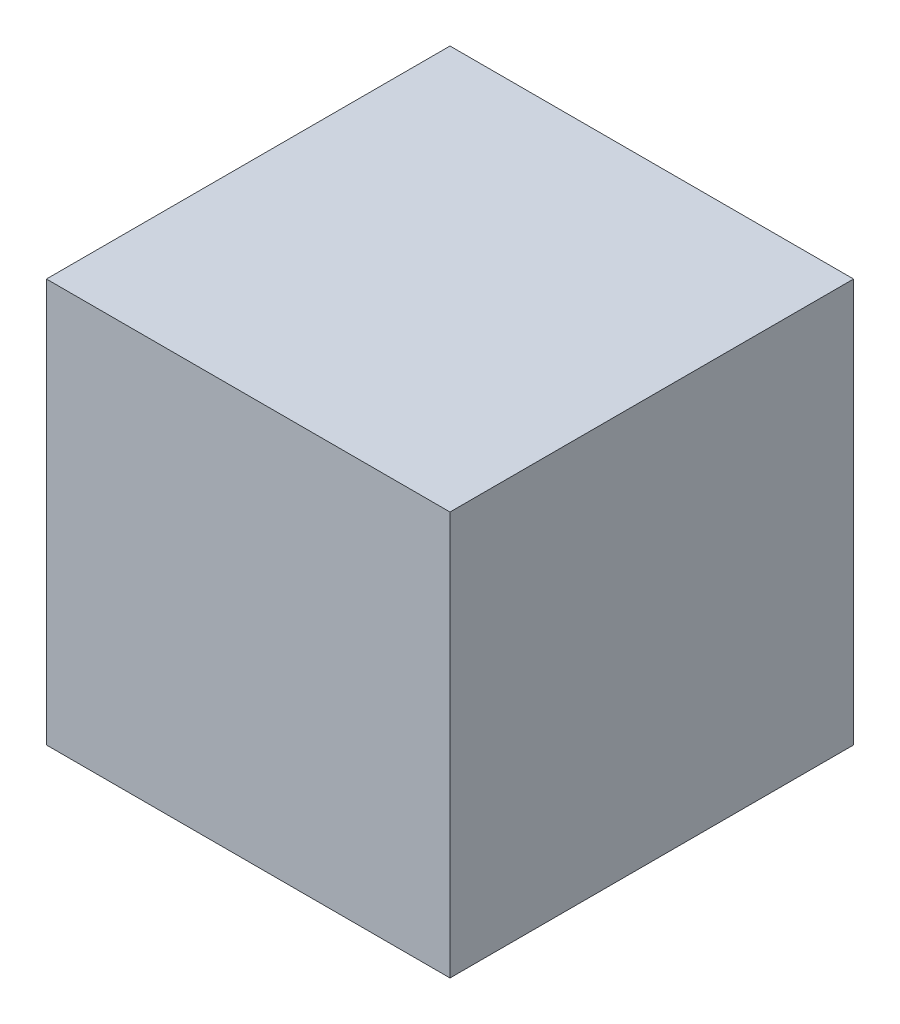
ISO-10303-21;
HEADER;
FILE_DESCRIPTION(('STEP AP214'),'2;1');
FILE_NAME('part.step','',(''),(''),'','','');
FILE_SCHEMA(('AUTOMOTIVE_DESIGN { 1 0 10303 214 1 1 1 1 }'));
ENDSEC;
DATA;
#1=APPLICATION_CONTEXT('core data for automotive mechanical design processes');
#2=APPLICATION_PROTOCOL_DEFINITION('international standard','automotive_design',2000,#1);
#3=PRODUCT_CONTEXT('',#1,'mechanical');
#4=PRODUCT('Part','Part','',(#3));
#5=PRODUCT_RELATED_PRODUCT_CATEGORY('part','',(#4));
#6=PRODUCT_DEFINITION_FORMATION('','',#4);
#7=PRODUCT_DEFINITION_CONTEXT('part definition',#1,'design');
#8=PRODUCT_DEFINITION('design','',#6,#7);
#9=PRODUCT_DEFINITION_SHAPE('','',#8);
#10=(LENGTH_UNIT() NAMED_UNIT(*) SI_UNIT(.MILLI.,.METRE.));
#11=(NAMED_UNIT(*) PLANE_ANGLE_UNIT() SI_UNIT($,.RADIAN.));
#12=(NAMED_UNIT(*) SI_UNIT($,.STERADIAN.) SOLID_ANGLE_UNIT());
#13=UNCERTAINTY_MEASURE_WITH_UNIT(LENGTH_MEASURE(1.E-05),#10,'distance_accuracy_value','');
#14=(GEOMETRIC_REPRESENTATION_CONTEXT(3) GLOBAL_UNCERTAINTY_ASSIGNED_CONTEXT((#13)) GLOBAL_UNIT_ASSIGNED_CONTEXT((#10,
#11,#12)) REPRESENTATION_CONTEXT('',''));
#15=CARTESIAN_POINT('',(0.,0.,0.));
#16=DIRECTION('',(0.,0.,1.));
#17=DIRECTION('',(1.,0.,0.));
#18=AXIS2_PLACEMENT_3D('',#15,#16,#17);
#19=CARTESIAN_POINT('',(0.,0.,25.4));
#20=DIRECTION('',(1.,0.,0.));
#21=DIRECTION('',(0.,0.,-1.));
#22=AXIS2_PLACEMENT_3D('',#19,#20,#21);
#23=PLANE('',#22);
#24=DIRECTION('',(0.,-1.,0.));
#25=VECTOR('',#24,1.);
#26=CARTESIAN_POINT('',(0.,0.,0.));
#27=LINE('',#26,#25);
#28=CARTESIAN_POINT('',(0.,25.4,0.));
#29=VERTEX_POINT('',#28);
#30=CARTESIAN_POINT('',(0.,0.,0.));
#31=VERTEX_POINT('',#30);
#32=EDGE_CURVE('E97',#29,#31,#27,.T.);
#33=ORIENTED_EDGE('',*,*,#32,.T.);
#34=DIRECTION('',(0.,0.,-1.));
#35=VECTOR('',#34,1.);
#36=CARTESIAN_POINT('',(0.,0.,25.4));
#37=LINE('',#36,#35);
#38=CARTESIAN_POINT('',(0.,0.,25.4));
#39=VERTEX_POINT('',#38);
#40=EDGE_CURVE('E11',#39,#31,#37,.T.);
#41=ORIENTED_EDGE('',*,*,#40,.F.);
#42=DIRECTION('',(0.,-1.,0.));
#43=VECTOR('',#42,1.);
#44=CARTESIAN_POINT('',(0.,0.,25.4));
#45=LINE('',#44,#43);
#46=CARTESIAN_POINT('',(0.,25.4,25.4));
#47=VERTEX_POINT('',#46);
#48=EDGE_CURVE('E85',#47,#39,#45,.T.);
#49=ORIENTED_EDGE('',*,*,#48,.F.);
#50=DIRECTION('',(0.,0.,-1.));
#51=VECTOR('',#50,1.);
#52=CARTESIAN_POINT('',(0.,25.4,25.4));
#53=LINE('',#52,#51);
#54=EDGE_CURVE('E93',#47,#29,#53,.T.);
#55=ORIENTED_EDGE('',*,*,#54,.T.);
#56=EDGE_LOOP('',(#33,#41,#49,#55));
#57=FACE_BOUND('',#56,.T.);
#58=ADVANCED_FACE('F34',(#57),#23,.F.);
#59=CARTESIAN_POINT('',(0.,0.,25.4));
#60=DIRECTION('',(0.,1.,0.));
#61=DIRECTION('',(0.,0.,1.));
#62=AXIS2_PLACEMENT_3D('',#59,#60,#61);
#63=PLANE('',#62);
#64=DIRECTION('',(1.,0.,0.));
#65=VECTOR('',#64,1.);
#66=CARTESIAN_POINT('',(0.,0.,0.));
#67=LINE('',#66,#65);
#68=CARTESIAN_POINT('',(25.4,0.,0.));
#69=VERTEX_POINT('',#68);
#70=EDGE_CURVE('E89',#31,#69,#67,.T.);
#71=ORIENTED_EDGE('',*,*,#70,.T.);
#72=DIRECTION('',(0.,0.,-1.));
#73=VECTOR('',#72,1.);
#74=CARTESIAN_POINT('',(25.4,0.,25.4));
#75=LINE('',#74,#73);
#76=CARTESIAN_POINT('',(25.4,0.,25.4));
#77=VERTEX_POINT('',#76);
#78=EDGE_CURVE('E42',#77,#69,#75,.T.);
#79=ORIENTED_EDGE('',*,*,#78,.F.);
#80=DIRECTION('',(1.,0.,0.));
#81=VECTOR('',#80,1.);
#82=CARTESIAN_POINT('',(0.,0.,25.4));
#83=LINE('',#82,#81);
#84=EDGE_CURVE('E80',#39,#77,#83,.T.);
#85=ORIENTED_EDGE('',*,*,#84,.F.);
#86=ORIENTED_EDGE('',*,*,#40,.T.);
#87=EDGE_LOOP('',(#71,#79,#85,#86));
#88=FACE_BOUND('',#87,.T.);
#89=ADVANCED_FACE('F88',(#88),#63,.F.);
#90=CARTESIAN_POINT('',(25.4,0.,25.4));
#91=DIRECTION('',(-1.,0.,0.));
#92=DIRECTION('',(0.,0.,1.));
#93=AXIS2_PLACEMENT_3D('',#90,#91,#92);
#94=PLANE('',#93);
#95=DIRECTION('',(0.,1.,0.));
#96=VECTOR('',#95,1.);
#97=CARTESIAN_POINT('',(25.4,0.,0.));
#98=LINE('',#97,#96);
#99=CARTESIAN_POINT('',(25.4,25.4,0.));
#100=VERTEX_POINT('',#99);
#101=EDGE_CURVE('E67',#69,#100,#98,.T.);
#102=ORIENTED_EDGE('',*,*,#101,.T.);
#103=DIRECTION('',(0.,0.,-1.));
#104=VECTOR('',#103,1.);
#105=CARTESIAN_POINT('',(25.4,25.4,25.4));
#106=LINE('',#105,#104);
#107=CARTESIAN_POINT('',(25.4,25.4,25.4));
#108=VERTEX_POINT('',#107);
#109=EDGE_CURVE('E90',#108,#100,#106,.T.);
#110=ORIENTED_EDGE('',*,*,#109,.F.);
#111=DIRECTION('',(0.,1.,0.));
#112=VECTOR('',#111,1.);
#113=CARTESIAN_POINT('',(25.4,0.,25.4));
#114=LINE('',#113,#112);
#115=EDGE_CURVE('E83',#77,#108,#114,.T.);
#116=ORIENTED_EDGE('',*,*,#115,.F.);
#117=ORIENTED_EDGE('',*,*,#78,.T.);
#118=EDGE_LOOP('',(#102,#110,#116,#117));
#119=FACE_BOUND('',#118,.T.);
#120=ADVANCED_FACE('F91',(#119),#94,.F.);
#121=CARTESIAN_POINT('',(0.,25.4,25.4));
#122=DIRECTION('',(0.,-1.,0.));
#123=DIRECTION('',(0.,0.,-1.));
#124=AXIS2_PLACEMENT_3D('',#121,#122,#123);
#125=PLANE('',#124);
#126=DIRECTION('',(-1.,0.,0.));
#127=VECTOR('',#126,1.);
#128=CARTESIAN_POINT('',(0.,25.4,0.));
#129=LINE('',#128,#127);
#130=EDGE_CURVE('E73',#100,#29,#129,.T.);
#131=ORIENTED_EDGE('',*,*,#130,.T.);
#132=ORIENTED_EDGE('',*,*,#54,.F.);
#133=DIRECTION('',(-1.,0.,0.));
#134=VECTOR('',#133,1.);
#135=CARTESIAN_POINT('',(0.,25.4,25.4));
#136=LINE('',#135,#134);
#137=EDGE_CURVE('E50',#108,#47,#136,.T.);
#138=ORIENTED_EDGE('',*,*,#137,.F.);
#139=ORIENTED_EDGE('',*,*,#109,.T.);
#140=EDGE_LOOP('',(#131,#132,#138,#139));
#141=FACE_BOUND('',#140,.T.);
#142=ADVANCED_FACE('F104',(#141),#125,.F.);
#143=CARTESIAN_POINT('',(0.,0.,25.4));
#144=DIRECTION('',(0.,0.,-1.));
#145=DIRECTION('',(-1.,0.,0.));
#146=AXIS2_PLACEMENT_3D('',#143,#144,#145);
#147=PLANE('',#146);
#148=ORIENTED_EDGE('',*,*,#48,.T.);
#149=ORIENTED_EDGE('',*,*,#84,.T.);
#150=ORIENTED_EDGE('',*,*,#115,.T.);
#151=ORIENTED_EDGE('',*,*,#137,.T.);
#152=EDGE_LOOP('',(#148,#149,#150,#151));
#153=FACE_BOUND('',#152,.T.);
#154=ADVANCED_FACE('F81',(#153),#147,.F.);
#155=CARTESIAN_POINT('',(0.,0.,0.));
#156=DIRECTION('',(0.,0.,-1.));
#157=DIRECTION('',(-1.,0.,0.));
#158=AXIS2_PLACEMENT_3D('',#155,#156,#157);
#159=PLANE('',#158);
#160=ORIENTED_EDGE('',*,*,#32,.F.);
#161=ORIENTED_EDGE('',*,*,#130,.F.);
#162=ORIENTED_EDGE('',*,*,#101,.F.);
#163=ORIENTED_EDGE('',*,*,#70,.F.);
#164=EDGE_LOOP('',(#160,#161,#162,#163));
#165=FACE_BOUND('',#164,.T.);
#166=ADVANCED_FACE('F107',(#165),#159,.T.);
#167=CLOSED_SHELL('',(#58,#89,#120,#142,#154,#166));
#168=MANIFOLD_SOLID_BREP('B2',#167);
#169=ADVANCED_BREP_SHAPE_REPRESENTATION('',(#18,#168),#14);
#170=SHAPE_DEFINITION_REPRESENTATION(#9,#169);
ENDSEC;
END-ISO-10303-21;
